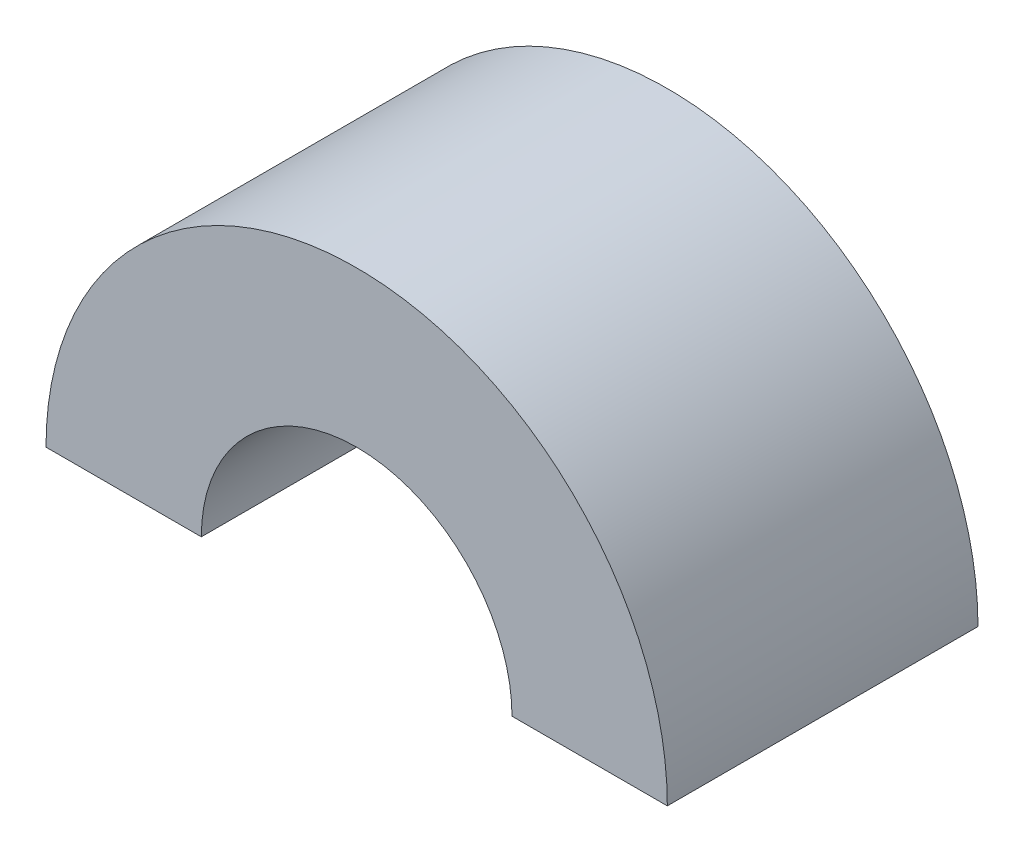
ISO-10303-21;
HEADER;
FILE_DESCRIPTION(('STEP AP214'),'2;1');
FILE_NAME('part.step','',(''),(''),'','','');
FILE_SCHEMA(('AUTOMOTIVE_DESIGN { 1 0 10303 214 1 1 1 1 }'));
ENDSEC;
DATA;
#1=APPLICATION_CONTEXT('core data for automotive mechanical design processes');
#2=APPLICATION_PROTOCOL_DEFINITION('international standard','automotive_design',2000,#1);
#3=PRODUCT_CONTEXT('',#1,'mechanical');
#4=PRODUCT('Part','Part','',(#3));
#5=PRODUCT_RELATED_PRODUCT_CATEGORY('part','',(#4));
#6=PRODUCT_DEFINITION_FORMATION('','',#4);
#7=PRODUCT_DEFINITION_CONTEXT('part definition',#1,'design');
#8=PRODUCT_DEFINITION('design','',#6,#7);
#9=PRODUCT_DEFINITION_SHAPE('','',#8);
#10=(LENGTH_UNIT() NAMED_UNIT(*) SI_UNIT(.MILLI.,.METRE.));
#11=(NAMED_UNIT(*) PLANE_ANGLE_UNIT() SI_UNIT($,.RADIAN.));
#12=(NAMED_UNIT(*) SI_UNIT($,.STERADIAN.) SOLID_ANGLE_UNIT());
#13=UNCERTAINTY_MEASURE_WITH_UNIT(LENGTH_MEASURE(1.E-05),#10,'distance_accuracy_value','');
#14=(GEOMETRIC_REPRESENTATION_CONTEXT(3) GLOBAL_UNCERTAINTY_ASSIGNED_CONTEXT((#13)) GLOBAL_UNIT_ASSIGNED_CONTEXT((#10,
#11,#12)) REPRESENTATION_CONTEXT('',''));
#15=CARTESIAN_POINT('',(0.,0.,0.));
#16=DIRECTION('',(0.,0.,1.));
#17=DIRECTION('',(1.,0.,0.));
#18=AXIS2_PLACEMENT_3D('',#15,#16,#17);
#19=CARTESIAN_POINT('',(0.,0.,15.));
#20=DIRECTION('',(0.,0.,-1.));
#21=DIRECTION('',(-1.,0.,0.));
#22=AXIS2_PLACEMENT_3D('',#19,#20,#21);
#23=CYLINDRICAL_SURFACE('',#22,15.);
#24=CARTESIAN_POINT('',(0.,0.,0.));
#25=DIRECTION('',(0.,0.,1.));
#26=DIRECTION('',(-1.,0.,0.));
#27=AXIS2_PLACEMENT_3D('',#24,#25,#26);
#28=CIRCLE('',#27,15.);
#29=CARTESIAN_POINT('',(15.,0.,0.));
#30=VERTEX_POINT('',#29);
#31=CARTESIAN_POINT('',(-15.,0.,0.));
#32=VERTEX_POINT('',#31);
#33=EDGE_CURVE('E104',#30,#32,#28,.T.);
#34=ORIENTED_EDGE('',*,*,#33,.T.);
#35=DIRECTION('',(0.,0.,-1.));
#36=VECTOR('',#35,1.);
#37=CARTESIAN_POINT('',(-15.,0.,15.));
#38=LINE('',#37,#36);
#39=CARTESIAN_POINT('',(-15.,0.,15.));
#40=VERTEX_POINT('',#39);
#41=EDGE_CURVE('E11',#40,#32,#38,.T.);
#42=ORIENTED_EDGE('',*,*,#41,.F.);
#43=CARTESIAN_POINT('',(0.,0.,15.));
#44=DIRECTION('',(0.,0.,1.));
#45=DIRECTION('',(-1.,0.,0.));
#46=AXIS2_PLACEMENT_3D('',#43,#44,#45);
#47=CIRCLE('',#46,15.);
#48=CARTESIAN_POINT('',(15.,0.,15.));
#49=VERTEX_POINT('',#48);
#50=EDGE_CURVE('E87',#49,#40,#47,.T.);
#51=ORIENTED_EDGE('',*,*,#50,.F.);
#52=DIRECTION('',(0.,0.,-1.));
#53=VECTOR('',#52,1.);
#54=CARTESIAN_POINT('',(15.,0.,15.));
#55=LINE('',#54,#53);
#56=EDGE_CURVE('E100',#49,#30,#55,.T.);
#57=ORIENTED_EDGE('',*,*,#56,.T.);
#58=EDGE_LOOP('',(#34,#42,#51,#57));
#59=FACE_BOUND('',#58,.T.);
#60=ADVANCED_FACE('F35',(#59),#23,.T.);
#61=CARTESIAN_POINT('',(-15.,0.,15.));
#62=DIRECTION('',(0.,1.,0.));
#63=DIRECTION('',(0.,0.,1.));
#64=AXIS2_PLACEMENT_3D('',#61,#62,#63);
#65=PLANE('',#64);
#66=DIRECTION('',(1.,0.,0.));
#67=VECTOR('',#66,1.);
#68=CARTESIAN_POINT('',(-15.,0.,0.));
#69=LINE('',#68,#67);
#70=CARTESIAN_POINT('',(-7.50000000000001,0.,0.));
#71=VERTEX_POINT('',#70);
#72=EDGE_CURVE('E92',#32,#71,#69,.T.);
#73=ORIENTED_EDGE('',*,*,#72,.T.);
#74=DIRECTION('',(0.,0.,-1.));
#75=VECTOR('',#74,1.);
#76=CARTESIAN_POINT('',(-7.50000000000001,0.,15.));
#77=LINE('',#76,#75);
#78=CARTESIAN_POINT('',(-7.50000000000001,0.,15.));
#79=VERTEX_POINT('',#78);
#80=EDGE_CURVE('E44',#79,#71,#77,.T.);
#81=ORIENTED_EDGE('',*,*,#80,.F.);
#82=DIRECTION('',(1.,0.,0.));
#83=VECTOR('',#82,1.);
#84=CARTESIAN_POINT('',(-15.,0.,15.));
#85=LINE('',#84,#83);
#86=EDGE_CURVE('E82',#40,#79,#85,.T.);
#87=ORIENTED_EDGE('',*,*,#86,.F.);
#88=ORIENTED_EDGE('',*,*,#41,.T.);
#89=EDGE_LOOP('',(#73,#81,#87,#88));
#90=FACE_BOUND('',#89,.T.);
#91=ADVANCED_FACE('F91',(#90),#65,.F.);
#92=CARTESIAN_POINT('',(0.,0.,15.));
#93=DIRECTION('',(0.,0.,-1.));
#94=DIRECTION('',(-1.,0.,0.));
#95=AXIS2_PLACEMENT_3D('',#92,#93,#94);
#96=CYLINDRICAL_SURFACE('',#95,7.5);
#97=CARTESIAN_POINT('',(0.,0.,0.));
#98=DIRECTION('',(0.,0.,-1.));
#99=DIRECTION('',(-1.,0.,0.));
#100=AXIS2_PLACEMENT_3D('',#97,#98,#99);
#101=CIRCLE('',#100,7.5);
#102=CARTESIAN_POINT('',(7.5,0.,0.));
#103=VERTEX_POINT('',#102);
#104=EDGE_CURVE('E69',#71,#103,#101,.T.);
#105=ORIENTED_EDGE('',*,*,#104,.T.);
#106=DIRECTION('',(0.,0.,-1.));
#107=VECTOR('',#106,1.);
#108=CARTESIAN_POINT('',(7.5,0.,15.));
#109=LINE('',#108,#107);
#110=CARTESIAN_POINT('',(7.5,0.,15.));
#111=VERTEX_POINT('',#110);
#112=EDGE_CURVE('E94',#111,#103,#109,.T.);
#113=ORIENTED_EDGE('',*,*,#112,.F.);
#114=CARTESIAN_POINT('',(0.,0.,15.));
#115=DIRECTION('',(0.,0.,-1.));
#116=DIRECTION('',(-1.,0.,0.));
#117=AXIS2_PLACEMENT_3D('',#114,#115,#116);
#118=CIRCLE('',#117,7.5);
#119=EDGE_CURVE('E85',#79,#111,#118,.T.);
#120=ORIENTED_EDGE('',*,*,#119,.F.);
#121=ORIENTED_EDGE('',*,*,#80,.T.);
#122=EDGE_LOOP('',(#105,#113,#120,#121));
#123=FACE_BOUND('',#122,.T.);
#124=ADVANCED_FACE('F95',(#123),#96,.F.);
#125=CARTESIAN_POINT('',(7.5,0.,15.));
#126=DIRECTION('',(0.,1.,0.));
#127=DIRECTION('',(0.,0.,1.));
#128=AXIS2_PLACEMENT_3D('',#125,#126,#127);
#129=PLANE('',#128);
#130=DIRECTION('',(1.,0.,0.));
#131=VECTOR('',#130,1.);
#132=CARTESIAN_POINT('',(7.5,0.,0.));
#133=LINE('',#132,#131);
#134=EDGE_CURVE('E75',#103,#30,#133,.T.);
#135=ORIENTED_EDGE('',*,*,#134,.T.);
#136=ORIENTED_EDGE('',*,*,#56,.F.);
#137=DIRECTION('',(1.,0.,0.));
#138=VECTOR('',#137,1.);
#139=CARTESIAN_POINT('',(7.5,0.,15.));
#140=LINE('',#139,#138);
#141=EDGE_CURVE('E52',#111,#49,#140,.T.);
#142=ORIENTED_EDGE('',*,*,#141,.F.);
#143=ORIENTED_EDGE('',*,*,#112,.T.);
#144=EDGE_LOOP('',(#135,#136,#142,#143));
#145=FACE_BOUND('',#144,.T.);
#146=ADVANCED_FACE('F118',(#145),#129,.F.);
#147=CARTESIAN_POINT('',(0.,0.,15.));
#148=DIRECTION('',(0.,0.,-1.));
#149=DIRECTION('',(-1.,0.,0.));
#150=AXIS2_PLACEMENT_3D('',#147,#148,#149);
#151=PLANE('',#150);
#152=ORIENTED_EDGE('',*,*,#50,.T.);
#153=ORIENTED_EDGE('',*,*,#86,.T.);
#154=ORIENTED_EDGE('',*,*,#119,.T.);
#155=ORIENTED_EDGE('',*,*,#141,.T.);
#156=EDGE_LOOP('',(#152,#153,#154,#155));
#157=FACE_BOUND('',#156,.T.);
#158=ADVANCED_FACE('F83',(#157),#151,.F.);
#159=CARTESIAN_POINT('',(0.,0.,0.));
#160=DIRECTION('',(0.,0.,-1.));
#161=DIRECTION('',(-1.,0.,0.));
#162=AXIS2_PLACEMENT_3D('',#159,#160,#161);
#163=PLANE('',#162);
#164=ORIENTED_EDGE('',*,*,#33,.F.);
#165=ORIENTED_EDGE('',*,*,#134,.F.);
#166=ORIENTED_EDGE('',*,*,#104,.F.);
#167=ORIENTED_EDGE('',*,*,#72,.F.);
#168=EDGE_LOOP('',(#164,#165,#166,#167));
#169=FACE_BOUND('',#168,.T.);
#170=ADVANCED_FACE('F121',(#169),#163,.T.);
#171=CLOSED_SHELL('',(#60,#91,#124,#146,#158,#170));
#172=MANIFOLD_SOLID_BREP('B2',#171);
#173=ADVANCED_BREP_SHAPE_REPRESENTATION('',(#18,#172),#14);
#174=SHAPE_DEFINITION_REPRESENTATION(#9,#173);
ENDSEC;
END-ISO-10303-21;
